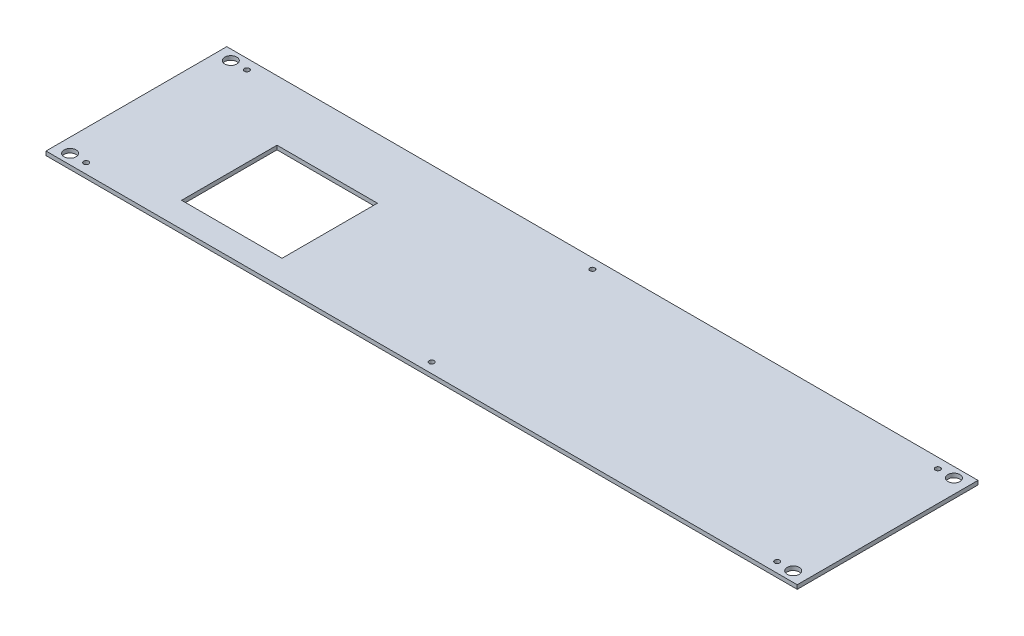
ISO-10303-21;
HEADER;
FILE_DESCRIPTION(('STEP AP214'),'2;1');
FILE_NAME('part.step','',(''),(''),'','','');
FILE_SCHEMA(('AUTOMOTIVE_DESIGN { 1 0 10303 214 1 1 1 1 }'));
ENDSEC;
DATA;
#1=APPLICATION_CONTEXT('core data for automotive mechanical design processes');
#2=APPLICATION_PROTOCOL_DEFINITION('international standard','automotive_design',2000,#1);
#3=PRODUCT_CONTEXT('',#1,'mechanical');
#4=PRODUCT('Part','Part','',(#3));
#5=PRODUCT_RELATED_PRODUCT_CATEGORY('part','',(#4));
#6=PRODUCT_DEFINITION_FORMATION('','',#4);
#7=PRODUCT_DEFINITION_CONTEXT('part definition',#1,'design');
#8=PRODUCT_DEFINITION('design','',#6,#7);
#9=PRODUCT_DEFINITION_SHAPE('','',#8);
#10=(LENGTH_UNIT() NAMED_UNIT(*) SI_UNIT(.MILLI.,.METRE.));
#11=(NAMED_UNIT(*) PLANE_ANGLE_UNIT() SI_UNIT($,.RADIAN.));
#12=(NAMED_UNIT(*) SI_UNIT($,.STERADIAN.) SOLID_ANGLE_UNIT());
#13=UNCERTAINTY_MEASURE_WITH_UNIT(LENGTH_MEASURE(1.E-05),#10,'distance_accuracy_value','');
#14=(GEOMETRIC_REPRESENTATION_CONTEXT(3) GLOBAL_UNCERTAINTY_ASSIGNED_CONTEXT((#13)) GLOBAL_UNIT_ASSIGNED_CONTEXT((#10,
#11,#12)) REPRESENTATION_CONTEXT('',''));
#15=CARTESIAN_POINT('',(0.,0.,0.));
#16=DIRECTION('',(0.,0.,1.));
#17=DIRECTION('',(1.,0.,0.));
#18=AXIS2_PLACEMENT_3D('',#15,#16,#17);
#19=CARTESIAN_POINT('',(0.,4.,0.));
#20=DIRECTION('',(0.,-1.,0.));
#21=DIRECTION('',(0.,0.,-1.));
#22=AXIS2_PLACEMENT_3D('',#19,#20,#21);
#23=PLANE('',#22);
#24=CARTESIAN_POINT('',(-360.,4.,80.));
#25=DIRECTION('',(0.,1.,0.));
#26=DIRECTION('',(0.,0.,-1.));
#27=AXIS2_PLACEMENT_3D('',#24,#25,#26);
#28=CIRCLE('',#27,5.99999999999999);
#29=CARTESIAN_POINT('',(-360.,4.,74.));
#30=VERTEX_POINT('',#29);
#31=EDGE_CURVE('E156',#30,#30,#28,.T.);
#32=ORIENTED_EDGE('',*,*,#31,.F.);
#33=EDGE_LOOP('',(#32));
#34=FACE_BOUND('',#33,.T.);
#35=CARTESIAN_POINT('',(-360.,4.,-80.));
#36=DIRECTION('',(0.,1.,0.));
#37=DIRECTION('',(0.,0.,1.));
#38=AXIS2_PLACEMENT_3D('',#35,#36,#37);
#39=CIRCLE('',#38,5.99999999999999);
#40=CARTESIAN_POINT('',(-360.,4.,-74.));
#41=VERTEX_POINT('',#40);
#42=EDGE_CURVE('E164',#41,#41,#39,.T.);
#43=ORIENTED_EDGE('',*,*,#42,.F.);
#44=EDGE_LOOP('',(#43));
#45=FACE_BOUND('',#44,.T.);
#46=CARTESIAN_POINT('',(344.,4.,80.0000000000001));
#47=DIRECTION('',(0.,1.,0.));
#48=DIRECTION('',(0.,0.,1.));
#49=AXIS2_PLACEMENT_3D('',#46,#47,#48);
#50=CIRCLE('',#49,2.50000000000002);
#51=CARTESIAN_POINT('',(344.,4.,82.5000000000001));
#52=VERTEX_POINT('',#51);
#53=EDGE_CURVE('E172',#52,#52,#50,.T.);
#54=ORIENTED_EDGE('',*,*,#53,.F.);
#55=EDGE_LOOP('',(#54));
#56=FACE_BOUND('',#55,.T.);
#57=CARTESIAN_POINT('',(0.,4.,80.0000000000001));
#58=DIRECTION('',(0.,1.,0.));
#59=DIRECTION('',(0.,0.,-1.));
#60=AXIS2_PLACEMENT_3D('',#57,#58,#59);
#61=CIRCLE('',#60,2.5);
#62=CARTESIAN_POINT('',(0.,4.,77.5000000000001));
#63=VERTEX_POINT('',#62);
#64=EDGE_CURVE('E180',#63,#63,#61,.T.);
#65=ORIENTED_EDGE('',*,*,#64,.F.);
#66=EDGE_LOOP('',(#65));
#67=FACE_BOUND('',#66,.T.);
#68=CARTESIAN_POINT('',(-344.,4.,80.));
#69=DIRECTION('',(0.,1.,0.));
#70=DIRECTION('',(0.,0.,-1.));
#71=AXIS2_PLACEMENT_3D('',#68,#69,#70);
#72=CIRCLE('',#71,2.50000000000002);
#73=CARTESIAN_POINT('',(-344.,4.,77.5));
#74=VERTEX_POINT('',#73);
#75=EDGE_CURVE('E188',#74,#74,#72,.T.);
#76=ORIENTED_EDGE('',*,*,#75,.F.);
#77=EDGE_LOOP('',(#76));
#78=FACE_BOUND('',#77,.T.);
#79=CARTESIAN_POINT('',(0.,4.,-80.));
#80=DIRECTION('',(0.,1.,0.));
#81=DIRECTION('',(0.,0.,1.));
#82=AXIS2_PLACEMENT_3D('',#79,#80,#81);
#83=CIRCLE('',#82,2.5);
#84=CARTESIAN_POINT('',(0.,4.,-77.5));
#85=VERTEX_POINT('',#84);
#86=EDGE_CURVE('E196',#85,#85,#83,.T.);
#87=ORIENTED_EDGE('',*,*,#86,.F.);
#88=EDGE_LOOP('',(#87));
#89=FACE_BOUND('',#88,.T.);
#90=CARTESIAN_POINT('',(344.,4.,-80.0000000000001));
#91=DIRECTION('',(0.,1.,0.));
#92=DIRECTION('',(0.,0.,-1.));
#93=AXIS2_PLACEMENT_3D('',#90,#91,#92);
#94=CIRCLE('',#93,2.50000000000002);
#95=CARTESIAN_POINT('',(344.,4.,-82.5000000000001));
#96=VERTEX_POINT('',#95);
#97=EDGE_CURVE('E204',#96,#96,#94,.T.);
#98=ORIENTED_EDGE('',*,*,#97,.F.);
#99=EDGE_LOOP('',(#98));
#100=FACE_BOUND('',#99,.T.);
#101=CARTESIAN_POINT('',(-344.,4.,-80.));
#102=DIRECTION('',(0.,1.,0.));
#103=DIRECTION('',(0.,0.,1.));
#104=AXIS2_PLACEMENT_3D('',#101,#102,#103);
#105=CIRCLE('',#104,2.50000000000002);
#106=CARTESIAN_POINT('',(-344.,4.,-77.5));
#107=VERTEX_POINT('',#106);
#108=EDGE_CURVE('E212',#107,#107,#105,.T.);
#109=ORIENTED_EDGE('',*,*,#108,.F.);
#110=EDGE_LOOP('',(#109));
#111=FACE_BOUND('',#110,.T.);
#112=DIRECTION('',(0.,0.,-1.));
#113=VECTOR('',#112,1.);
#114=CARTESIAN_POINT('',(374.,4.,89.9999999999997));
#115=LINE('',#114,#113);
#116=CARTESIAN_POINT('',(374.,4.,89.9999999999997));
#117=VERTEX_POINT('',#116);
#118=CARTESIAN_POINT('',(374.,4.,-89.9999999999997));
#119=VERTEX_POINT('',#118);
#120=EDGE_CURVE('E220',#117,#119,#115,.T.);
#121=ORIENTED_EDGE('',*,*,#120,.T.);
#122=DIRECTION('',(-1.,0.,0.));
#123=VECTOR('',#122,1.);
#124=CARTESIAN_POINT('',(-374.,4.,-90.));
#125=LINE('',#124,#123);
#126=CARTESIAN_POINT('',(-374.,4.,-90.));
#127=VERTEX_POINT('',#126);
#128=EDGE_CURVE('E224',#119,#127,#125,.T.);
#129=ORIENTED_EDGE('',*,*,#128,.T.);
#130=DIRECTION('',(0.,0.,1.));
#131=VECTOR('',#130,1.);
#132=CARTESIAN_POINT('',(-374.,4.,90.));
#133=LINE('',#132,#131);
#134=CARTESIAN_POINT('',(-374.,4.,90.));
#135=VERTEX_POINT('',#134);
#136=EDGE_CURVE('E228',#127,#135,#133,.T.);
#137=ORIENTED_EDGE('',*,*,#136,.T.);
#138=DIRECTION('',(1.,0.,0.));
#139=VECTOR('',#138,1.);
#140=CARTESIAN_POINT('',(-374.,4.,90.));
#141=LINE('',#140,#139);
#142=EDGE_CURVE('E231',#135,#117,#141,.T.);
#143=ORIENTED_EDGE('',*,*,#142,.T.);
#144=EDGE_LOOP('',(#121,#129,#137,#143));
#145=FACE_BOUND('',#144,.T.);
#146=DIRECTION('',(0.,0.,-1.));
#147=VECTOR('',#146,1.);
#148=CARTESIAN_POINT('',(-164.,4.,65.));
#149=LINE('',#148,#147);
#150=CARTESIAN_POINT('',(-164.,4.,65.));
#151=VERTEX_POINT('',#150);
#152=CARTESIAN_POINT('',(-164.,4.,-30.));
#153=VERTEX_POINT('',#152);
#154=EDGE_CURVE('E105',#151,#153,#149,.T.);
#155=ORIENTED_EDGE('',*,*,#154,.F.);
#156=DIRECTION('',(1.,0.,0.));
#157=VECTOR('',#156,1.);
#158=CARTESIAN_POINT('',(-264.,4.,65.));
#159=LINE('',#158,#157);
#160=CARTESIAN_POINT('',(-264.,4.,65.));
#161=VERTEX_POINT('',#160);
#162=EDGE_CURVE('E132',#161,#151,#159,.T.);
#163=ORIENTED_EDGE('',*,*,#162,.F.);
#164=DIRECTION('',(0.,0.,1.));
#165=VECTOR('',#164,1.);
#166=CARTESIAN_POINT('',(-264.,4.,65.));
#167=LINE('',#166,#165);
#168=CARTESIAN_POINT('',(-264.,4.,-30.));
#169=VERTEX_POINT('',#168);
#170=EDGE_CURVE('E128',#169,#161,#167,.T.);
#171=ORIENTED_EDGE('',*,*,#170,.F.);
#172=DIRECTION('',(-1.,0.,0.));
#173=VECTOR('',#172,1.);
#174=CARTESIAN_POINT('',(-264.,4.,-30.));
#175=LINE('',#174,#173);
#176=EDGE_CURVE('E114',#153,#169,#175,.T.);
#177=ORIENTED_EDGE('',*,*,#176,.F.);
#178=EDGE_LOOP('',(#155,#163,#171,#177));
#179=FACE_BOUND('',#178,.T.);
#180=CARTESIAN_POINT('',(360.,4.,79.9999999999999));
#181=DIRECTION('',(0.,1.,0.));
#182=DIRECTION('',(0.,0.,1.));
#183=AXIS2_PLACEMENT_3D('',#180,#181,#182);
#184=CIRCLE('',#183,5.99999999999999);
#185=CARTESIAN_POINT('',(360.,4.,85.9999999999999));
#186=VERTEX_POINT('',#185);
#187=EDGE_CURVE('E140',#186,#186,#184,.T.);
#188=ORIENTED_EDGE('',*,*,#187,.F.);
#189=EDGE_LOOP('',(#188));
#190=FACE_BOUND('',#189,.T.);
#191=CARTESIAN_POINT('',(360.,4.,-80.));
#192=DIRECTION('',(0.,1.,0.));
#193=DIRECTION('',(0.,0.,-1.));
#194=AXIS2_PLACEMENT_3D('',#191,#192,#193);
#195=CIRCLE('',#194,5.99999999999999);
#196=CARTESIAN_POINT('',(360.,4.,-86.));
#197=VERTEX_POINT('',#196);
#198=EDGE_CURVE('E361',#197,#197,#195,.T.);
#199=ORIENTED_EDGE('',*,*,#198,.F.);
#200=EDGE_LOOP('',(#199));
#201=FACE_BOUND('',#200,.T.);
#202=ADVANCED_FACE('F39',(#34,#45,#56,#67,#78,#89,#100,#111,#145,#179,#190,#201),#23,.F.);
#203=CARTESIAN_POINT('',(0.,0.,0.));
#204=DIRECTION('',(0.,-1.,0.));
#205=DIRECTION('',(0.,0.,-1.));
#206=AXIS2_PLACEMENT_3D('',#203,#204,#205);
#207=PLANE('',#206);
#208=CARTESIAN_POINT('',(360.,0.,79.9999999999999));
#209=DIRECTION('',(0.,1.,0.));
#210=DIRECTION('',(0.,0.,1.));
#211=AXIS2_PLACEMENT_3D('',#208,#209,#210);
#212=CIRCLE('',#211,5.99999999999999);
#213=CARTESIAN_POINT('',(360.,0.,85.9999999999999));
#214=VERTEX_POINT('',#213);
#215=EDGE_CURVE('E369',#214,#214,#212,.T.);
#216=ORIENTED_EDGE('',*,*,#215,.T.);
#217=EDGE_LOOP('',(#216));
#218=FACE_BOUND('',#217,.T.);
#219=CARTESIAN_POINT('',(-360.,0.,-80.));
#220=DIRECTION('',(0.,1.,0.));
#221=DIRECTION('',(0.,0.,1.));
#222=AXIS2_PLACEMENT_3D('',#219,#220,#221);
#223=CIRCLE('',#222,5.99999999999999);
#224=CARTESIAN_POINT('',(-360.,0.,-74.));
#225=VERTEX_POINT('',#224);
#226=EDGE_CURVE('E160',#225,#225,#223,.T.);
#227=ORIENTED_EDGE('',*,*,#226,.T.);
#228=EDGE_LOOP('',(#227));
#229=FACE_BOUND('',#228,.T.);
#230=CARTESIAN_POINT('',(0.,0.,80.0000000000001));
#231=DIRECTION('',(0.,1.,0.));
#232=DIRECTION('',(0.,0.,-1.));
#233=AXIS2_PLACEMENT_3D('',#230,#231,#232);
#234=CIRCLE('',#233,2.5);
#235=CARTESIAN_POINT('',(0.,0.,77.5000000000001));
#236=VERTEX_POINT('',#235);
#237=EDGE_CURVE('E176',#236,#236,#234,.T.);
#238=ORIENTED_EDGE('',*,*,#237,.T.);
#239=EDGE_LOOP('',(#238));
#240=FACE_BOUND('',#239,.T.);
#241=CARTESIAN_POINT('',(0.,0.,-80.));
#242=DIRECTION('',(0.,1.,0.));
#243=DIRECTION('',(0.,0.,1.));
#244=AXIS2_PLACEMENT_3D('',#241,#242,#243);
#245=CIRCLE('',#244,2.5);
#246=CARTESIAN_POINT('',(0.,0.,-77.5));
#247=VERTEX_POINT('',#246);
#248=EDGE_CURVE('E192',#247,#247,#245,.T.);
#249=ORIENTED_EDGE('',*,*,#248,.T.);
#250=EDGE_LOOP('',(#249));
#251=FACE_BOUND('',#250,.T.);
#252=CARTESIAN_POINT('',(-344.,0.,-80.));
#253=DIRECTION('',(0.,1.,0.));
#254=DIRECTION('',(0.,0.,1.));
#255=AXIS2_PLACEMENT_3D('',#252,#253,#254);
#256=CIRCLE('',#255,2.50000000000002);
#257=CARTESIAN_POINT('',(-344.,0.,-77.5));
#258=VERTEX_POINT('',#257);
#259=EDGE_CURVE('E208',#258,#258,#256,.T.);
#260=ORIENTED_EDGE('',*,*,#259,.T.);
#261=EDGE_LOOP('',(#260));
#262=FACE_BOUND('',#261,.T.);
#263=DIRECTION('',(0.,0.,-1.));
#264=VECTOR('',#263,1.);
#265=CARTESIAN_POINT('',(374.,0.,89.9999999999997));
#266=LINE('',#265,#264);
#267=CARTESIAN_POINT('',(374.,0.,89.9999999999997));
#268=VERTEX_POINT('',#267);
#269=CARTESIAN_POINT('',(374.,0.,-89.9999999999997));
#270=VERTEX_POINT('',#269);
#271=EDGE_CURVE('E216',#268,#270,#266,.T.);
#272=ORIENTED_EDGE('',*,*,#271,.F.);
#273=DIRECTION('',(1.,0.,0.));
#274=VECTOR('',#273,1.);
#275=CARTESIAN_POINT('',(-374.,0.,90.));
#276=LINE('',#275,#274);
#277=CARTESIAN_POINT('',(-374.,0.,90.));
#278=VERTEX_POINT('',#277);
#279=EDGE_CURVE('E225',#278,#268,#276,.T.);
#280=ORIENTED_EDGE('',*,*,#279,.F.);
#281=DIRECTION('',(0.,0.,1.));
#282=VECTOR('',#281,1.);
#283=CARTESIAN_POINT('',(-374.,0.,90.));
#284=LINE('',#283,#282);
#285=CARTESIAN_POINT('',(-374.,0.,-90.));
#286=VERTEX_POINT('',#285);
#287=EDGE_CURVE('E241',#286,#278,#284,.T.);
#288=ORIENTED_EDGE('',*,*,#287,.F.);
#289=DIRECTION('',(-1.,0.,0.));
#290=VECTOR('',#289,1.);
#291=CARTESIAN_POINT('',(-374.,0.,-90.));
#292=LINE('',#291,#290);
#293=EDGE_CURVE('E238',#270,#286,#292,.T.);
#294=ORIENTED_EDGE('',*,*,#293,.F.);
#295=EDGE_LOOP('',(#272,#280,#288,#294));
#296=FACE_BOUND('',#295,.T.);
#297=CARTESIAN_POINT('',(344.,0.,-80.0000000000001));
#298=DIRECTION('',(0.,1.,0.));
#299=DIRECTION('',(0.,0.,-1.));
#300=AXIS2_PLACEMENT_3D('',#297,#298,#299);
#301=CIRCLE('',#300,2.50000000000002);
#302=CARTESIAN_POINT('',(344.,0.,-82.5000000000001));
#303=VERTEX_POINT('',#302);
#304=EDGE_CURVE('E200',#303,#303,#301,.T.);
#305=ORIENTED_EDGE('',*,*,#304,.T.);
#306=EDGE_LOOP('',(#305));
#307=FACE_BOUND('',#306,.T.);
#308=CARTESIAN_POINT('',(-344.,0.,80.));
#309=DIRECTION('',(0.,1.,0.));
#310=DIRECTION('',(0.,0.,-1.));
#311=AXIS2_PLACEMENT_3D('',#308,#309,#310);
#312=CIRCLE('',#311,2.50000000000002);
#313=CARTESIAN_POINT('',(-344.,0.,77.5));
#314=VERTEX_POINT('',#313);
#315=EDGE_CURVE('E184',#314,#314,#312,.T.);
#316=ORIENTED_EDGE('',*,*,#315,.T.);
#317=EDGE_LOOP('',(#316));
#318=FACE_BOUND('',#317,.T.);
#319=CARTESIAN_POINT('',(344.,0.,80.0000000000001));
#320=DIRECTION('',(0.,1.,0.));
#321=DIRECTION('',(0.,0.,1.));
#322=AXIS2_PLACEMENT_3D('',#319,#320,#321);
#323=CIRCLE('',#322,2.50000000000002);
#324=CARTESIAN_POINT('',(344.,0.,82.5000000000001));
#325=VERTEX_POINT('',#324);
#326=EDGE_CURVE('E168',#325,#325,#323,.T.);
#327=ORIENTED_EDGE('',*,*,#326,.T.);
#328=EDGE_LOOP('',(#327));
#329=FACE_BOUND('',#328,.T.);
#330=CARTESIAN_POINT('',(-360.,0.,80.));
#331=DIRECTION('',(0.,1.,0.));
#332=DIRECTION('',(0.,0.,-1.));
#333=AXIS2_PLACEMENT_3D('',#330,#331,#332);
#334=CIRCLE('',#333,5.99999999999999);
#335=CARTESIAN_POINT('',(-360.,0.,74.));
#336=VERTEX_POINT('',#335);
#337=EDGE_CURVE('E123',#336,#336,#334,.T.);
#338=ORIENTED_EDGE('',*,*,#337,.T.);
#339=EDGE_LOOP('',(#338));
#340=FACE_BOUND('',#339,.T.);
#341=DIRECTION('',(1.,0.,0.));
#342=VECTOR('',#341,1.);
#343=CARTESIAN_POINT('',(-264.,0.,65.));
#344=LINE('',#343,#342);
#345=CARTESIAN_POINT('',(-264.,0.,65.));
#346=VERTEX_POINT('',#345);
#347=CARTESIAN_POINT('',(-164.,0.,65.));
#348=VERTEX_POINT('',#347);
#349=EDGE_CURVE('E115',#346,#348,#344,.T.);
#350=ORIENTED_EDGE('',*,*,#349,.T.);
#351=DIRECTION('',(0.,0.,-1.));
#352=VECTOR('',#351,1.);
#353=CARTESIAN_POINT('',(-164.,0.,65.));
#354=LINE('',#353,#352);
#355=CARTESIAN_POINT('',(-164.,0.,-30.));
#356=VERTEX_POINT('',#355);
#357=EDGE_CURVE('E63',#348,#356,#354,.T.);
#358=ORIENTED_EDGE('',*,*,#357,.T.);
#359=DIRECTION('',(-1.,0.,0.));
#360=VECTOR('',#359,1.);
#361=CARTESIAN_POINT('',(-264.,0.,-30.));
#362=LINE('',#361,#360);
#363=CARTESIAN_POINT('',(-264.,0.,-30.));
#364=VERTEX_POINT('',#363);
#365=EDGE_CURVE('E121',#356,#364,#362,.T.);
#366=ORIENTED_EDGE('',*,*,#365,.T.);
#367=DIRECTION('',(0.,0.,1.));
#368=VECTOR('',#367,1.);
#369=CARTESIAN_POINT('',(-264.,0.,65.));
#370=LINE('',#369,#368);
#371=EDGE_CURVE('E143',#364,#346,#370,.T.);
#372=ORIENTED_EDGE('',*,*,#371,.T.);
#373=EDGE_LOOP('',(#350,#358,#366,#372));
#374=FACE_BOUND('',#373,.T.);
#375=CARTESIAN_POINT('',(360.,0.,-80.));
#376=DIRECTION('',(0.,1.,0.));
#377=DIRECTION('',(0.,0.,-1.));
#378=AXIS2_PLACEMENT_3D('',#375,#376,#377);
#379=CIRCLE('',#378,5.99999999999999);
#380=CARTESIAN_POINT('',(360.,0.,-86.));
#381=VERTEX_POINT('',#380);
#382=EDGE_CURVE('E364',#381,#381,#379,.T.);
#383=ORIENTED_EDGE('',*,*,#382,.T.);
#384=EDGE_LOOP('',(#383));
#385=FACE_BOUND('',#384,.T.);
#386=ADVANCED_FACE('F264',(#218,#229,#240,#251,#262,#296,#307,#318,#329,#340,#374,#385),#207,.T.);
#387=CARTESIAN_POINT('',(374.,4.,89.9999999999997));
#388=DIRECTION('',(-1.,0.,0.));
#389=DIRECTION('',(0.,0.,1.));
#390=AXIS2_PLACEMENT_3D('',#387,#388,#389);
#391=PLANE('',#390);
#392=ORIENTED_EDGE('',*,*,#271,.T.);
#393=DIRECTION('',(0.,-1.,0.));
#394=VECTOR('',#393,1.);
#395=CARTESIAN_POINT('',(374.,4.,-89.9999999999997));
#396=LINE('',#395,#394);
#397=EDGE_CURVE('E11',#119,#270,#396,.T.);
#398=ORIENTED_EDGE('',*,*,#397,.F.);
#399=ORIENTED_EDGE('',*,*,#120,.F.);
#400=DIRECTION('',(0.,-1.,0.));
#401=VECTOR('',#400,1.);
#402=CARTESIAN_POINT('',(374.,4.,89.9999999999997));
#403=LINE('',#402,#401);
#404=EDGE_CURVE('E234',#117,#268,#403,.T.);
#405=ORIENTED_EDGE('',*,*,#404,.T.);
#406=EDGE_LOOP('',(#392,#398,#399,#405));
#407=FACE_BOUND('',#406,.T.);
#408=ADVANCED_FACE('F41',(#407),#391,.F.);
#409=CARTESIAN_POINT('',(-374.,4.,-90.));
#410=DIRECTION('',(0.,0.,1.));
#411=DIRECTION('',(1.,0.,0.));
#412=AXIS2_PLACEMENT_3D('',#409,#410,#411);
#413=PLANE('',#412);
#414=ORIENTED_EDGE('',*,*,#293,.T.);
#415=DIRECTION('',(0.,-1.,0.));
#416=VECTOR('',#415,1.);
#417=CARTESIAN_POINT('',(-374.,4.,-90.));
#418=LINE('',#417,#416);
#419=EDGE_CURVE('E48',#127,#286,#418,.T.);
#420=ORIENTED_EDGE('',*,*,#419,.F.);
#421=ORIENTED_EDGE('',*,*,#128,.F.);
#422=ORIENTED_EDGE('',*,*,#397,.T.);
#423=EDGE_LOOP('',(#414,#420,#421,#422));
#424=FACE_BOUND('',#423,.T.);
#425=ADVANCED_FACE('F274',(#424),#413,.F.);
#426=CARTESIAN_POINT('',(-374.,4.,90.));
#427=DIRECTION('',(1.,0.,0.));
#428=DIRECTION('',(0.,0.,-1.));
#429=AXIS2_PLACEMENT_3D('',#426,#427,#428);
#430=PLANE('',#429);
#431=ORIENTED_EDGE('',*,*,#287,.T.);
#432=DIRECTION('',(0.,-1.,0.));
#433=VECTOR('',#432,1.);
#434=CARTESIAN_POINT('',(-374.,4.,90.));
#435=LINE('',#434,#433);
#436=EDGE_CURVE('E249',#135,#278,#435,.T.);
#437=ORIENTED_EDGE('',*,*,#436,.F.);
#438=ORIENTED_EDGE('',*,*,#136,.F.);
#439=ORIENTED_EDGE('',*,*,#419,.T.);
#440=EDGE_LOOP('',(#431,#437,#438,#439));
#441=FACE_BOUND('',#440,.T.);
#442=ADVANCED_FACE('F258',(#441),#430,.F.);
#443=CARTESIAN_POINT('',(-374.,4.,90.));
#444=DIRECTION('',(0.,0.,-1.));
#445=DIRECTION('',(-1.,0.,0.));
#446=AXIS2_PLACEMENT_3D('',#443,#444,#445);
#447=PLANE('',#446);
#448=ORIENTED_EDGE('',*,*,#279,.T.);
#449=ORIENTED_EDGE('',*,*,#404,.F.);
#450=ORIENTED_EDGE('',*,*,#142,.F.);
#451=ORIENTED_EDGE('',*,*,#436,.T.);
#452=EDGE_LOOP('',(#448,#449,#450,#451));
#453=FACE_BOUND('',#452,.T.);
#454=ADVANCED_FACE('F268',(#453),#447,.F.);
#455=CARTESIAN_POINT('',(-344.,4.,-80.));
#456=DIRECTION('',(0.,-1.,0.));
#457=DIRECTION('',(0.,0.,-1.));
#458=AXIS2_PLACEMENT_3D('',#455,#456,#457);
#459=CYLINDRICAL_SURFACE('',#458,2.50000000000002);
#460=ORIENTED_EDGE('',*,*,#108,.T.);
#461=EDGE_LOOP('',(#460));
#462=FACE_BOUND('',#461,.T.);
#463=ORIENTED_EDGE('',*,*,#259,.F.);
#464=EDGE_LOOP('',(#463));
#465=FACE_BOUND('',#464,.T.);
#466=ADVANCED_FACE('F292',(#462,#465),#459,.F.);
#467=CARTESIAN_POINT('',(344.,4.,-80.0000000000001));
#468=DIRECTION('',(0.,-1.,0.));
#469=DIRECTION('',(0.,0.,-1.));
#470=AXIS2_PLACEMENT_3D('',#467,#468,#469);
#471=CYLINDRICAL_SURFACE('',#470,2.50000000000002);
#472=ORIENTED_EDGE('',*,*,#97,.T.);
#473=EDGE_LOOP('',(#472));
#474=FACE_BOUND('',#473,.T.);
#475=ORIENTED_EDGE('',*,*,#304,.F.);
#476=EDGE_LOOP('',(#475));
#477=FACE_BOUND('',#476,.T.);
#478=ADVANCED_FACE('F299',(#474,#477),#471,.F.);
#479=CARTESIAN_POINT('',(0.,4.,-80.));
#480=DIRECTION('',(0.,-1.,0.));
#481=DIRECTION('',(0.,0.,-1.));
#482=AXIS2_PLACEMENT_3D('',#479,#480,#481);
#483=CYLINDRICAL_SURFACE('',#482,2.5);
#484=ORIENTED_EDGE('',*,*,#86,.T.);
#485=EDGE_LOOP('',(#484));
#486=FACE_BOUND('',#485,.T.);
#487=ORIENTED_EDGE('',*,*,#248,.F.);
#488=EDGE_LOOP('',(#487));
#489=FACE_BOUND('',#488,.T.);
#490=ADVANCED_FACE('F304',(#486,#489),#483,.F.);
#491=CARTESIAN_POINT('',(-344.,4.,80.));
#492=DIRECTION('',(0.,-1.,0.));
#493=DIRECTION('',(0.,0.,-1.));
#494=AXIS2_PLACEMENT_3D('',#491,#492,#493);
#495=CYLINDRICAL_SURFACE('',#494,2.50000000000002);
#496=ORIENTED_EDGE('',*,*,#75,.T.);
#497=EDGE_LOOP('',(#496));
#498=FACE_BOUND('',#497,.T.);
#499=ORIENTED_EDGE('',*,*,#315,.F.);
#500=EDGE_LOOP('',(#499));
#501=FACE_BOUND('',#500,.T.);
#502=ADVANCED_FACE('F314',(#498,#501),#495,.F.);
#503=CARTESIAN_POINT('',(0.,4.,80.0000000000001));
#504=DIRECTION('',(0.,-1.,0.));
#505=DIRECTION('',(0.,0.,-1.));
#506=AXIS2_PLACEMENT_3D('',#503,#504,#505);
#507=CYLINDRICAL_SURFACE('',#506,2.5);
#508=ORIENTED_EDGE('',*,*,#64,.T.);
#509=EDGE_LOOP('',(#508));
#510=FACE_BOUND('',#509,.T.);
#511=ORIENTED_EDGE('',*,*,#237,.F.);
#512=EDGE_LOOP('',(#511));
#513=FACE_BOUND('',#512,.T.);
#514=ADVANCED_FACE('F321',(#510,#513),#507,.F.);
#515=CARTESIAN_POINT('',(344.,4.,80.0000000000001));
#516=DIRECTION('',(0.,-1.,0.));
#517=DIRECTION('',(0.,0.,-1.));
#518=AXIS2_PLACEMENT_3D('',#515,#516,#517);
#519=CYLINDRICAL_SURFACE('',#518,2.50000000000002);
#520=ORIENTED_EDGE('',*,*,#53,.T.);
#521=EDGE_LOOP('',(#520));
#522=FACE_BOUND('',#521,.T.);
#523=ORIENTED_EDGE('',*,*,#326,.F.);
#524=EDGE_LOOP('',(#523));
#525=FACE_BOUND('',#524,.T.);
#526=ADVANCED_FACE('F325',(#522,#525),#519,.F.);
#527=CARTESIAN_POINT('',(-360.,4.,-80.));
#528=DIRECTION('',(0.,-1.,0.));
#529=DIRECTION('',(0.,0.,-1.));
#530=AXIS2_PLACEMENT_3D('',#527,#528,#529);
#531=CYLINDRICAL_SURFACE('',#530,5.99999999999999);
#532=ORIENTED_EDGE('',*,*,#42,.T.);
#533=EDGE_LOOP('',(#532));
#534=FACE_BOUND('',#533,.T.);
#535=ORIENTED_EDGE('',*,*,#226,.F.);
#536=EDGE_LOOP('',(#535));
#537=FACE_BOUND('',#536,.T.);
#538=ADVANCED_FACE('F329',(#534,#537),#531,.F.);
#539=CARTESIAN_POINT('',(-360.,4.,80.));
#540=DIRECTION('',(0.,-1.,0.));
#541=DIRECTION('',(0.,0.,-1.));
#542=AXIS2_PLACEMENT_3D('',#539,#540,#541);
#543=CYLINDRICAL_SURFACE('',#542,5.99999999999999);
#544=ORIENTED_EDGE('',*,*,#31,.T.);
#545=EDGE_LOOP('',(#544));
#546=FACE_BOUND('',#545,.T.);
#547=ORIENTED_EDGE('',*,*,#337,.F.);
#548=EDGE_LOOP('',(#547));
#549=FACE_BOUND('',#548,.T.);
#550=ADVANCED_FACE('F333',(#546,#549),#543,.F.);
#551=CARTESIAN_POINT('',(-164.,4.,65.));
#552=DIRECTION('',(-1.,0.,0.));
#553=DIRECTION('',(0.,0.,1.));
#554=AXIS2_PLACEMENT_3D('',#551,#552,#553);
#555=PLANE('',#554);
#556=ORIENTED_EDGE('',*,*,#357,.F.);
#557=DIRECTION('',(0.,-1.,0.));
#558=VECTOR('',#557,1.);
#559=CARTESIAN_POINT('',(-164.,4.,65.));
#560=LINE('',#559,#558);
#561=EDGE_CURVE('E109',#151,#348,#560,.T.);
#562=ORIENTED_EDGE('',*,*,#561,.F.);
#563=ORIENTED_EDGE('',*,*,#154,.T.);
#564=DIRECTION('',(0.,-1.,0.));
#565=VECTOR('',#564,1.);
#566=CARTESIAN_POINT('',(-164.,4.,-30.));
#567=LINE('',#566,#565);
#568=EDGE_CURVE('E108',#153,#356,#567,.T.);
#569=ORIENTED_EDGE('',*,*,#568,.T.);
#570=EDGE_LOOP('',(#556,#562,#563,#569));
#571=FACE_BOUND('',#570,.T.);
#572=ADVANCED_FACE('F107',(#571),#555,.T.);
#573=CARTESIAN_POINT('',(-264.,4.,-30.));
#574=DIRECTION('',(0.,0.,1.));
#575=DIRECTION('',(1.,0.,0.));
#576=AXIS2_PLACEMENT_3D('',#573,#574,#575);
#577=PLANE('',#576);
#578=ORIENTED_EDGE('',*,*,#365,.F.);
#579=ORIENTED_EDGE('',*,*,#568,.F.);
#580=ORIENTED_EDGE('',*,*,#176,.T.);
#581=DIRECTION('',(0.,-1.,0.));
#582=VECTOR('',#581,1.);
#583=CARTESIAN_POINT('',(-264.,4.,-30.));
#584=LINE('',#583,#582);
#585=EDGE_CURVE('E124',#169,#364,#584,.T.);
#586=ORIENTED_EDGE('',*,*,#585,.T.);
#587=EDGE_LOOP('',(#578,#579,#580,#586));
#588=FACE_BOUND('',#587,.T.);
#589=ADVANCED_FACE('F118',(#588),#577,.T.);
#590=CARTESIAN_POINT('',(-264.,4.,65.));
#591=DIRECTION('',(1.,0.,0.));
#592=DIRECTION('',(0.,0.,-1.));
#593=AXIS2_PLACEMENT_3D('',#590,#591,#592);
#594=PLANE('',#593);
#595=ORIENTED_EDGE('',*,*,#371,.F.);
#596=ORIENTED_EDGE('',*,*,#585,.F.);
#597=ORIENTED_EDGE('',*,*,#170,.T.);
#598=DIRECTION('',(0.,-1.,0.));
#599=VECTOR('',#598,1.);
#600=CARTESIAN_POINT('',(-264.,4.,65.));
#601=LINE('',#600,#599);
#602=EDGE_CURVE('E55',#161,#346,#601,.T.);
#603=ORIENTED_EDGE('',*,*,#602,.T.);
#604=EDGE_LOOP('',(#595,#596,#597,#603));
#605=FACE_BOUND('',#604,.T.);
#606=ADVANCED_FACE('F342',(#605),#594,.T.);
#607=CARTESIAN_POINT('',(-264.,4.,65.));
#608=DIRECTION('',(0.,0.,-1.));
#609=DIRECTION('',(-1.,0.,0.));
#610=AXIS2_PLACEMENT_3D('',#607,#608,#609);
#611=PLANE('',#610);
#612=ORIENTED_EDGE('',*,*,#349,.F.);
#613=ORIENTED_EDGE('',*,*,#602,.F.);
#614=ORIENTED_EDGE('',*,*,#162,.T.);
#615=ORIENTED_EDGE('',*,*,#561,.T.);
#616=EDGE_LOOP('',(#612,#613,#614,#615));
#617=FACE_BOUND('',#616,.T.);
#618=ADVANCED_FACE('F345',(#617),#611,.T.);
#619=CARTESIAN_POINT('',(360.,4.,79.9999999999999));
#620=DIRECTION('',(0.,-1.,0.));
#621=DIRECTION('',(0.,0.,-1.));
#622=AXIS2_PLACEMENT_3D('',#619,#620,#621);
#623=CYLINDRICAL_SURFACE('',#622,5.99999999999999);
#624=ORIENTED_EDGE('',*,*,#187,.T.);
#625=EDGE_LOOP('',(#624));
#626=FACE_BOUND('',#625,.T.);
#627=ORIENTED_EDGE('',*,*,#215,.F.);
#628=EDGE_LOOP('',(#627));
#629=FACE_BOUND('',#628,.T.);
#630=ADVANCED_FACE('F349',(#626,#629),#623,.F.);
#631=CARTESIAN_POINT('',(360.,4.,-80.));
#632=DIRECTION('',(0.,-1.,0.));
#633=DIRECTION('',(0.,0.,-1.));
#634=AXIS2_PLACEMENT_3D('',#631,#632,#633);
#635=CYLINDRICAL_SURFACE('',#634,5.99999999999999);
#636=ORIENTED_EDGE('',*,*,#198,.T.);
#637=EDGE_LOOP('',(#636));
#638=FACE_BOUND('',#637,.T.);
#639=ORIENTED_EDGE('',*,*,#382,.F.);
#640=EDGE_LOOP('',(#639));
#641=FACE_BOUND('',#640,.T.);
#642=ADVANCED_FACE('F352',(#638,#641),#635,.F.);
#643=CLOSED_SHELL('',(#202,#386,#408,#425,#442,#454,#466,#478,#490,#502,#514,#526,#538,#550,
#572,#589,#606,#618,#630,#642));
#644=MANIFOLD_SOLID_BREP('B2',#643);
#645=ADVANCED_BREP_SHAPE_REPRESENTATION('',(#18,#644),#14);
#646=SHAPE_DEFINITION_REPRESENTATION(#9,#645);
ENDSEC;
END-ISO-10303-21;
